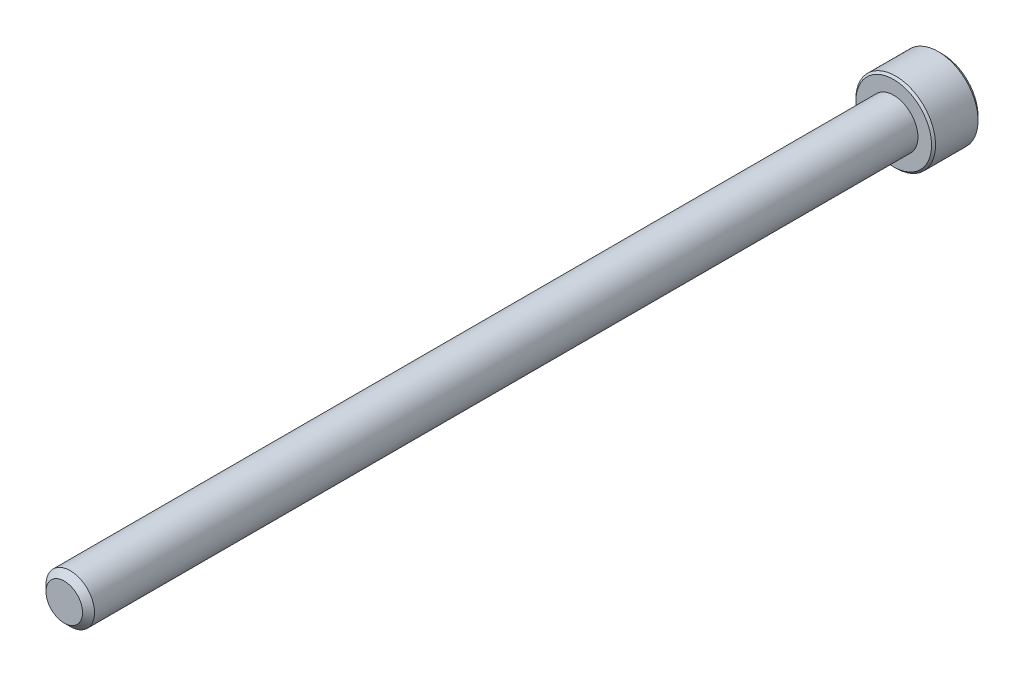
ISO-10303-21;
HEADER;
FILE_DESCRIPTION(('STEP AP214'),'2;1');
FILE_NAME('part.step','',(''),(''),'','','');
FILE_SCHEMA(('AUTOMOTIVE_DESIGN { 1 0 10303 214 1 1 1 1 }'));
ENDSEC;
DATA;
#1=APPLICATION_CONTEXT('core data for automotive mechanical design processes');
#2=APPLICATION_PROTOCOL_DEFINITION('international standard','automotive_design',2000,#1);
#3=PRODUCT_CONTEXT('',#1,'mechanical');
#4=PRODUCT('Part','Part','',(#3));
#5=PRODUCT_RELATED_PRODUCT_CATEGORY('part','',(#4));
#6=PRODUCT_DEFINITION_FORMATION('','',#4);
#7=PRODUCT_DEFINITION_CONTEXT('part definition',#1,'design');
#8=PRODUCT_DEFINITION('design','',#6,#7);
#9=PRODUCT_DEFINITION_SHAPE('','',#8);
#10=(LENGTH_UNIT() NAMED_UNIT(*) SI_UNIT(.MILLI.,.METRE.));
#11=(NAMED_UNIT(*) PLANE_ANGLE_UNIT() SI_UNIT($,.RADIAN.));
#12=(NAMED_UNIT(*) SI_UNIT($,.STERADIAN.) SOLID_ANGLE_UNIT());
#13=UNCERTAINTY_MEASURE_WITH_UNIT(LENGTH_MEASURE(1.E-05),#10,'distance_accuracy_value','');
#14=(GEOMETRIC_REPRESENTATION_CONTEXT(3) GLOBAL_UNCERTAINTY_ASSIGNED_CONTEXT((#13)) GLOBAL_UNIT_ASSIGNED_CONTEXT((#10,
#11,#12)) REPRESENTATION_CONTEXT('',''));
#15=CARTESIAN_POINT('',(0.,0.,0.));
#16=DIRECTION('',(0.,0.,1.));
#17=DIRECTION('',(1.,0.,0.));
#18=AXIS2_PLACEMENT_3D('',#15,#16,#17);
#19=CARTESIAN_POINT('',(0.,0.,-82.55));
#20=DIRECTION('',(0.,0.,1.));
#21=DIRECTION('',(1.,0.,0.));
#22=AXIS2_PLACEMENT_3D('',#19,#20,#21);
#23=CYLINDRICAL_SURFACE('',#22,2.413);
#24=CARTESIAN_POINT('',(0.,0.,-0.595312499999986));
#25=DIRECTION('',(0.,0.,1.));
#26=DIRECTION('',(1.,0.,0.));
#27=AXIS2_PLACEMENT_3D('',#24,#25,#26);
#28=CIRCLE('',#27,2.413);
#29=CARTESIAN_POINT('',(2.413,0.,-0.595312499999986));
#30=VERTEX_POINT('',#29);
#31=EDGE_CURVE('E118',#30,#30,#28,.F.);
#32=ORIENTED_EDGE('',*,*,#31,.T.);
#33=EDGE_LOOP('',(#32));
#34=FACE_BOUND('',#33,.T.);
#35=CARTESIAN_POINT('',(0.,0.,-82.55));
#36=DIRECTION('',(0.,0.,-1.));
#37=DIRECTION('',(-1.,0.,0.));
#38=AXIS2_PLACEMENT_3D('',#35,#36,#37);
#39=CIRCLE('',#38,2.413);
#40=CARTESIAN_POINT('',(-2.413,0.,-82.55));
#41=VERTEX_POINT('',#40);
#42=EDGE_CURVE('E230',#41,#41,#39,.F.);
#43=ORIENTED_EDGE('',*,*,#42,.T.);
#44=EDGE_LOOP('',(#43));
#45=FACE_BOUND('',#44,.T.);
#46=ADVANCED_FACE('F41',(#34,#45),#23,.T.);
#47=CARTESIAN_POINT('',(0.,0.,0.));
#48=DIRECTION('',(0.,0.,1.));
#49=DIRECTION('',(1.,0.,0.));
#50=AXIS2_PLACEMENT_3D('',#47,#48,#49);
#51=PLANE('',#50);
#52=CARTESIAN_POINT('',(0.,0.,0.));
#53=DIRECTION('',(0.,0.,1.));
#54=DIRECTION('',(1.,0.,0.));
#55=AXIS2_PLACEMENT_3D('',#52,#53,#54);
#56=CIRCLE('',#55,1.81768750000001);
#57=CARTESIAN_POINT('',(1.81768750000001,0.,0.));
#58=VERTEX_POINT('',#57);
#59=EDGE_CURVE('E228',#58,#58,#56,.T.);
#60=ORIENTED_EDGE('',*,*,#59,.T.);
#61=EDGE_LOOP('',(#60));
#62=FACE_BOUND('',#61,.T.);
#63=ADVANCED_FACE('F206',(#62),#51,.T.);
#64=CARTESIAN_POINT('',(0.,0.,0.));
#65=DIRECTION('',(0.,0.,-1.));
#66=DIRECTION('',(-1.,0.,0.));
#67=AXIS2_PLACEMENT_3D('',#64,#65,#66);
#68=CONICAL_SURFACE('',#67,1.81768750000001,0.785398163397449);
#69=ORIENTED_EDGE('',*,*,#31,.F.);
#70=EDGE_LOOP('',(#69));
#71=FACE_BOUND('',#70,.T.);
#72=ORIENTED_EDGE('',*,*,#59,.F.);
#73=EDGE_LOOP('',(#72));
#74=FACE_BOUND('',#73,.T.);
#75=ADVANCED_FACE('F212',(#71,#74),#68,.T.);
#76=CARTESIAN_POINT('',(0.,0.,-87.376));
#77=DIRECTION('',(0.,0.,1.));
#78=DIRECTION('',(1.,0.,0.));
#79=AXIS2_PLACEMENT_3D('',#76,#77,#78);
#80=CYLINDRICAL_SURFACE('',#79,3.96875);
#81=CARTESIAN_POINT('',(0.,0.,-82.7484375));
#82=DIRECTION('',(0.,0.,-1.));
#83=DIRECTION('',(-1.,0.,0.));
#84=AXIS2_PLACEMENT_3D('',#81,#82,#83);
#85=CIRCLE('',#84,3.96875);
#86=CARTESIAN_POINT('',(-3.96875,0.,-82.7484375));
#87=VERTEX_POINT('',#86);
#88=EDGE_CURVE('E50',#87,#87,#85,.T.);
#89=ORIENTED_EDGE('',*,*,#88,.T.);
#90=EDGE_LOOP('',(#89));
#91=FACE_BOUND('',#90,.T.);
#92=CARTESIAN_POINT('',(0.,0.,-86.979125));
#93=DIRECTION('',(0.,0.,-1.));
#94=DIRECTION('',(-1.,0.,0.));
#95=AXIS2_PLACEMENT_3D('',#92,#93,#94);
#96=CIRCLE('',#95,3.96875);
#97=CARTESIAN_POINT('',(-3.96875,0.,-86.979125));
#98=VERTEX_POINT('',#97);
#99=EDGE_CURVE('E187',#98,#98,#96,.F.);
#100=ORIENTED_EDGE('',*,*,#99,.T.);
#101=EDGE_LOOP('',(#100));
#102=FACE_BOUND('',#101,.T.);
#103=ADVANCED_FACE('F194',(#91,#102),#80,.T.);
#104=CARTESIAN_POINT('',(0.,0.,-87.376));
#105=DIRECTION('',(0.,0.,-1.));
#106=DIRECTION('',(-1.,0.,0.));
#107=AXIS2_PLACEMENT_3D('',#104,#105,#106);
#108=PLANE('',#107);
#109=CARTESIAN_POINT('',(0.,0.,-87.376));
#110=DIRECTION('',(0.,0.,-1.));
#111=DIRECTION('',(-1.,0.,0.));
#112=AXIS2_PLACEMENT_3D('',#109,#110,#111);
#113=CIRCLE('',#112,3.57187499999997);
#114=CARTESIAN_POINT('',(-3.57187499999997,0.,-87.376));
#115=VERTEX_POINT('',#114);
#116=EDGE_CURVE('E117',#115,#115,#113,.T.);
#117=ORIENTED_EDGE('',*,*,#116,.T.);
#118=EDGE_LOOP('',(#117));
#119=FACE_BOUND('',#118,.T.);
#120=CARTESIAN_POINT('',(0.,0.,-87.376));
#121=DIRECTION('',(0.,0.,-1.));
#122=DIRECTION('',(-1.,0.,0.));
#123=AXIS2_PLACEMENT_3D('',#120,#121,#122);
#124=CIRCLE('',#123,2.29135888084633);
#125=CARTESIAN_POINT('',(-1.984375,1.14567944042317,-87.376));
#126=VERTEX_POINT('',#125);
#127=CARTESIAN_POINT('',(0.,2.29135888084633,-87.376));
#128=VERTEX_POINT('',#127);
#129=EDGE_CURVE('E96',#126,#128,#124,.T.);
#130=ORIENTED_EDGE('',*,*,#129,.F.);
#131=CARTESIAN_POINT('',(-1.984375,-1.14567944042316,-87.376));
#132=VERTEX_POINT('',#131);
#133=EDGE_CURVE('E56',#132,#126,#124,.T.);
#134=ORIENTED_EDGE('',*,*,#133,.F.);
#135=CARTESIAN_POINT('',(0.,-2.29135888084633,-87.376));
#136=VERTEX_POINT('',#135);
#137=EDGE_CURVE('E303',#136,#132,#124,.T.);
#138=ORIENTED_EDGE('',*,*,#137,.F.);
#139=CARTESIAN_POINT('',(1.984375,-1.14567944042316,-87.376));
#140=VERTEX_POINT('',#139);
#141=EDGE_CURVE('E63',#140,#136,#124,.T.);
#142=ORIENTED_EDGE('',*,*,#141,.F.);
#143=CARTESIAN_POINT('',(1.984375,1.14567944042316,-87.376));
#144=VERTEX_POINT('',#143);
#145=EDGE_CURVE('E141',#144,#140,#124,.T.);
#146=ORIENTED_EDGE('',*,*,#145,.F.);
#147=EDGE_CURVE('E106',#128,#144,#124,.T.);
#148=ORIENTED_EDGE('',*,*,#147,.F.);
#149=EDGE_LOOP('',(#130,#134,#138,#142,#146,#148));
#150=FACE_BOUND('',#149,.T.);
#151=ADVANCED_FACE('F140',(#119,#150),#108,.T.);
#152=CARTESIAN_POINT('',(0.,0.,-82.55));
#153=DIRECTION('',(0.,0.,-1.));
#154=DIRECTION('',(-1.,0.,0.));
#155=AXIS2_PLACEMENT_3D('',#152,#153,#154);
#156=PLANE('',#155);
#157=CARTESIAN_POINT('',(0.,0.,-82.55));
#158=DIRECTION('',(0.,0.,-1.));
#159=DIRECTION('',(-1.,0.,0.));
#160=AXIS2_PLACEMENT_3D('',#157,#158,#159);
#161=CIRCLE('',#160,3.77031249999999);
#162=CARTESIAN_POINT('',(-3.77031249999999,0.,-82.55));
#163=VERTEX_POINT('',#162);
#164=EDGE_CURVE('E11',#163,#163,#161,.F.);
#165=ORIENTED_EDGE('',*,*,#164,.T.);
#166=EDGE_LOOP('',(#165));
#167=FACE_BOUND('',#166,.T.);
#168=ORIENTED_EDGE('',*,*,#42,.F.);
#169=EDGE_LOOP('',(#168));
#170=FACE_BOUND('',#169,.T.);
#171=ADVANCED_FACE('F320',(#167,#170),#156,.F.);
#172=CARTESIAN_POINT('',(0.,0.,-87.376));
#173=DIRECTION('',(0.,0.,-1.));
#174=DIRECTION('',(-1.,0.,0.));
#175=AXIS2_PLACEMENT_3D('',#172,#173,#174);
#176=CONICAL_SURFACE('',#175,2.29135888084633,0.78539816339745);
#177=ORIENTED_EDGE('',*,*,#147,.T.);
#178=CARTESIAN_POINT('',(-0.000199999999999604,2.29147435090016,-87.3761154787818));
#179=CARTESIAN_POINT('',(0.068015995166803,2.25208982772757,-87.3367628522639));
#180=CARTESIAN_POINT('',(0.137372685106966,2.21204672412052,-87.2997213104462));
#181=CARTESIAN_POINT('',(0.278798800452188,2.13039431835551,-87.2318988584233));
#182=CARTESIAN_POINT('',(0.350881678736784,2.08877724917394,-87.2011556890917));
#183=CARTESIAN_POINT('',(0.496233397266007,2.00485839535392,-87.1484918888112));
#184=CARTESIAN_POINT('',(0.569465212486942,1.96257798712286,-87.12643887588));
#185=CARTESIAN_POINT('',(0.71754118259471,1.87708628592063,-87.0924614929439));
#186=CARTESIAN_POINT('',(0.792380812753429,1.83387760530244,-87.0805117560917));
#187=CARTESIAN_POINT('',(0.92136041454382,1.75941119748879,-87.0697300990819));
#188=CARTESIAN_POINT('',(0.975333715772447,1.72824969749539,-87.0681338990591));
#189=CARTESIAN_POINT('',(1.08319211851981,1.66597761963484,-87.0708218388653));
#190=CARTESIAN_POINT('',(1.13707718248553,1.63486706344893,-87.0751080403405));
#191=CARTESIAN_POINT('',(1.24433853824861,1.57293969082547,-87.0893168730135));
#192=CARTESIAN_POINT('',(1.29771419276014,1.54212324232506,-87.0992458104523));
#193=CARTESIAN_POINT('',(1.4035425174089,1.48102323060121,-87.1241950842745));
#194=CARTESIAN_POINT('',(1.45599525797111,1.45073962671789,-87.1392150303895));
#195=CARTESIAN_POINT('',(1.59035733896365,1.37316564308797,-87.1838078516357));
#196=CARTESIAN_POINT('',(1.67143335715833,1.32635638215845,-87.2167429959383));
#197=CARTESIAN_POINT('',(1.79064830672984,1.25752759893191,-87.2723424412022));
#198=CARTESIAN_POINT('',(1.829934924386,1.23484545965257,-87.2918775920519));
#199=CARTESIAN_POINT('',(1.90778036186806,1.18990137536712,-87.3327287381194));
#200=CARTESIAN_POINT('',(1.9463396111017,1.16763918244233,-87.3540436395683));
#201=CARTESIAN_POINT('',(1.984575,1.14556397036933,-87.3761154787818));
#202=B_SPLINE_CURVE_WITH_KNOTS('',3,(#178,#179,#180,#181,#182,#183,#184,#185,#186,#187,#188,
#189,#190,#191,#192,#193,#194,#195,#196,#197,#198,#199,#200,#201),.UNSPECIFIED.,.F.,.F.,(4,2,2,
2,2,2,2,2,2,2,2,4),(0.,0.264339630306625,0.530219665093696,0.791876416371465,1.0528742441811,
1.23963984393201,1.42647091743853,1.61351120244035,1.80053715247541,2.09764209964316,
2.24579179873714,2.39385111134157),.UNSPECIFIED.);
#203=EDGE_CURVE('E111',#128,#144,#202,.T.);
#204=ORIENTED_EDGE('',*,*,#203,.F.);
#205=EDGE_LOOP('',(#177,#204));
#206=FACE_BOUND('',#205,.T.);
#207=ADVANCED_FACE('F112',(#206),#176,.F.);
#208=ORIENTED_EDGE('',*,*,#145,.T.);
#209=CARTESIAN_POINT('',(1.984375,-2.28495242191067,-88.1109840790676));
#210=CARTESIAN_POINT('',(1.984375,-2.22931635487714,-88.0689866857921));
#211=CARTESIAN_POINT('',(1.984375,-2.17336876579766,-88.027396054308));
#212=CARTESIAN_POINT('',(1.984375,-2.06072770287667,-87.9452084616839));
#213=CARTESIAN_POINT('',(1.984375,-2.00403404531986,-87.9046117526079));
#214=CARTESIAN_POINT('',(1.984375,-1.88936329200117,-87.8243035033582));
#215=CARTESIAN_POINT('',(1.984375,-1.83137965544999,-87.7846012589872));
#216=CARTESIAN_POINT('',(1.984375,-1.71442802161519,-87.706685173556));
#217=CARTESIAN_POINT('',(1.984375,-1.65546009429911,-87.6684712273396));
#218=CARTESIAN_POINT('',(1.984375,-1.47005472325436,-87.5522528341287));
#219=CARTESIAN_POINT('',(1.984375,-1.3416390944495,-87.4773478869673));
#220=CARTESIAN_POINT('',(1.984375,-1.07840384717679,-87.3403302154972));
#221=CARTESIAN_POINT('',(1.984375,-0.943607781504103,-87.2781743665226));
#222=CARTESIAN_POINT('',(1.984375,-0.741275100522515,-87.202132578716));
#223=CARTESIAN_POINT('',(1.984375,-0.676735408966705,-87.1803080613539));
#224=CARTESIAN_POINT('',(1.984375,-0.546098118214585,-87.1418404635651));
#225=CARTESIAN_POINT('',(1.984375,-0.480000412030015,-87.1251977400917));
#226=CARTESIAN_POINT('',(1.984375,-0.347746170154792,-87.0982353808918));
#227=CARTESIAN_POINT('',(1.984375,-0.281612071613344,-87.087807409755));
#228=CARTESIAN_POINT('',(1.984375,-0.148636620202226,-87.0734781473881));
#229=CARTESIAN_POINT('',(1.984375,-0.0817953908968931,-87.0695757342341));
#230=CARTESIAN_POINT('',(1.984375,0.0495156749172992,-87.0685870513286));
#231=CARTESIAN_POINT('',(1.984375,0.113983774924704,-87.071259178865));
#232=CARTESIAN_POINT('',(1.984375,0.242367515655498,-87.0827392104746));
#233=CARTESIAN_POINT('',(1.984375,0.306283102099371,-87.0915477106093));
#234=CARTESIAN_POINT('',(1.984375,0.434181040054047,-87.1149690212885));
#235=CARTESIAN_POINT('',(1.984375,0.498145026644471,-87.1296806061801));
#236=CARTESIAN_POINT('',(1.984375,0.624675616728318,-87.1641261813447));
#237=CARTESIAN_POINT('',(1.984375,0.68724233666985,-87.183859751374));
#238=CARTESIAN_POINT('',(1.984375,0.884225483546202,-87.2534122371188));
#239=CARTESIAN_POINT('',(1.984375,1.0158367422424,-87.3111524111108));
#240=CARTESIAN_POINT('',(1.984375,1.27288659202272,-87.4395303363718));
#241=CARTESIAN_POINT('',(1.984375,1.39830088226188,-87.5102144246649));
#242=CARTESIAN_POINT('',(1.984375,1.57956687940502,-87.6205166635036));
#243=CARTESIAN_POINT('',(1.984375,1.63738271248116,-87.6569698291489));
#244=CARTESIAN_POINT('',(1.984375,1.7520221533174,-87.7314159629313));
#245=CARTESIAN_POINT('',(1.984375,1.80884568545334,-87.7694090477006));
#246=CARTESIAN_POINT('',(1.984375,1.92116923025134,-87.8463388084819));
#247=CARTESIAN_POINT('',(1.984375,1.97667624451604,-87.8852653126108));
#248=CARTESIAN_POINT('',(1.984375,2.08693170653471,-87.9641477456598));
#249=CARTESIAN_POINT('',(1.984375,2.14168035869579,-88.0041033885457));
#250=CARTESIAN_POINT('',(1.984375,2.19611148979893,-88.0444806107903));
#251=B_SPLINE_CURVE_WITH_KNOTS('',3,(#209,#210,#211,#212,#213,#214,#215,#216,#217,#218,#219,
#220,#221,#222,#223,#224,#225,#226,#227,#228,#229,#230,#231,#232,#233,#234,#235,#236,#237,#238,
#239,#240,#241,#242,#243,#244,#245,#246,#247,#248,#249,#250),.UNSPECIFIED.,.F.,.F.,(4,2,2,2,2,2,
2,2,2,2,2,2,2,2,2,2,2,2,2,2,4),(0.,0.209126070048126,0.418304637436192,0.629103980098184,
0.839888401531932,1.28549951141298,1.72957750802533,1.93379389781847,2.13802435216271,
2.33858179541699,2.53910475375796,2.7323696342393,2.92565329027999,3.12231577116422,
3.31896180058102,3.7488629524628,4.18033428110717,4.38536017158907,4.5904016196826,
4.79377749130339,4.99709743482715),.UNSPECIFIED.);
#252=EDGE_CURVE('E105',#144,#140,#251,.F.);
#253=ORIENTED_EDGE('',*,*,#252,.F.);
#254=EDGE_LOOP('',(#208,#253));
#255=FACE_BOUND('',#254,.T.);
#256=ADVANCED_FACE('F314',(#255),#176,.F.);
#257=ORIENTED_EDGE('',*,*,#141,.T.);
#258=CARTESIAN_POINT('',(1.984575,-1.14556397036933,-87.3761154787818));
#259=CARTESIAN_POINT('',(1.9163590048332,-1.18494849354192,-87.3367628522639));
#260=CARTESIAN_POINT('',(1.84700231489303,-1.22499159714897,-87.2997213104462));
#261=CARTESIAN_POINT('',(1.70557619954781,-1.30664400291398,-87.2318988584233));
#262=CARTESIAN_POINT('',(1.63349332126322,-1.34826107209555,-87.2011556890917));
#263=CARTESIAN_POINT('',(1.48814160273399,-1.43217992591557,-87.1484918888112));
#264=CARTESIAN_POINT('',(1.41490978751306,-1.47446033414663,-87.12643887588));
#265=CARTESIAN_POINT('',(1.26683381740529,-1.55995203534886,-87.0924614929439));
#266=CARTESIAN_POINT('',(1.19199418724657,-1.60316071596705,-87.0805117560917));
#267=CARTESIAN_POINT('',(1.06301458545618,-1.6776271237807,-87.0697300990819));
#268=CARTESIAN_POINT('',(1.00904128422755,-1.7087886237741,-87.0681338990591));
#269=CARTESIAN_POINT('',(0.901182881480196,-1.77106070163465,-87.0708218388653));
#270=CARTESIAN_POINT('',(0.847297817514473,-1.80217125782056,-87.0751080403405));
#271=CARTESIAN_POINT('',(0.740036461751391,-1.86409863044402,-87.0893168730135));
#272=CARTESIAN_POINT('',(0.686660807239855,-1.89491507894443,-87.0992458104523));
#273=CARTESIAN_POINT('',(0.580832482591098,-1.95601509066828,-87.1241950842745));
#274=CARTESIAN_POINT('',(0.528379742028893,-1.9862986945516,-87.1392150303895));
#275=CARTESIAN_POINT('',(0.394017661036344,-2.06387267818153,-87.1838078516357));
#276=CARTESIAN_POINT('',(0.312941642841666,-2.11068193911105,-87.2167429959383));
#277=CARTESIAN_POINT('',(0.193726693270153,-2.17951072233759,-87.2723424412022));
#278=CARTESIAN_POINT('',(0.154440075613995,-2.20219286161692,-87.2918775920519));
#279=CARTESIAN_POINT('',(0.0765946381319476,-2.24713694590237,-87.3327287381194));
#280=CARTESIAN_POINT('',(0.038035388898302,-2.26939913882716,-87.3540436395683));
#281=CARTESIAN_POINT('',(-0.00019999999999915,-2.29147435090016,-87.3761154787818));
#282=B_SPLINE_CURVE_WITH_KNOTS('',3,(#258,#259,#260,#261,#262,#263,#264,#265,#266,#267,#268,
#269,#270,#271,#272,#273,#274,#275,#276,#277,#278,#279,#280,#281),.UNSPECIFIED.,.F.,.F.,(4,2,2,
2,2,2,2,2,2,2,2,4),(0.,0.264339630306625,0.530219665093696,0.791876416371465,1.0528742441811,
1.23963984393201,1.42647091743853,1.61351120244035,1.80053715247541,2.09764209964318,
2.24579179873714,2.39385111134157),.UNSPECIFIED.);
#283=EDGE_CURVE('E154',#140,#136,#282,.T.);
#284=ORIENTED_EDGE('',*,*,#283,.F.);
#285=EDGE_LOOP('',(#257,#284));
#286=FACE_BOUND('',#285,.T.);
#287=ADVANCED_FACE('F311',(#286),#176,.F.);
#288=ORIENTED_EDGE('',*,*,#137,.T.);
#289=CARTESIAN_POINT('',(0.000199999999999881,-2.29147435090016,-87.3761154787818));
#290=CARTESIAN_POINT('',(-0.0680159951668027,-2.25208982772757,-87.3367628522639));
#291=CARTESIAN_POINT('',(-0.137372685106966,-2.21204672412052,-87.2997213104462));
#292=CARTESIAN_POINT('',(-0.278798800452188,-2.13039431835551,-87.2318988584233));
#293=CARTESIAN_POINT('',(-0.350881678736784,-2.08877724917394,-87.2011556890917));
#294=CARTESIAN_POINT('',(-0.496233397266007,-2.00485839535392,-87.1484918888112));
#295=CARTESIAN_POINT('',(-0.569465212486941,-1.96257798712286,-87.12643887588));
#296=CARTESIAN_POINT('',(-0.71754118259471,-1.87708628592063,-87.0924614929439));
#297=CARTESIAN_POINT('',(-0.792380812753429,-1.83387760530244,-87.0805117560917));
#298=CARTESIAN_POINT('',(-0.92136041454382,-1.75941119748879,-87.0697300990819));
#299=CARTESIAN_POINT('',(-0.975333715772447,-1.72824969749539,-87.0681338990591));
#300=CARTESIAN_POINT('',(-1.08319211851981,-1.66597761963484,-87.0708218388653));
#301=CARTESIAN_POINT('',(-1.13707718248553,-1.63486706344893,-87.0751080403405));
#302=CARTESIAN_POINT('',(-1.24433853824861,-1.57293969082547,-87.0893168730135));
#303=CARTESIAN_POINT('',(-1.29771419276014,-1.54212324232506,-87.0992458104523));
#304=CARTESIAN_POINT('',(-1.4035425174089,-1.48102323060121,-87.1241950842745));
#305=CARTESIAN_POINT('',(-1.45599525797111,-1.45073962671789,-87.1392150303895));
#306=CARTESIAN_POINT('',(-1.59035733896365,-1.37316564308797,-87.1838078516357));
#307=CARTESIAN_POINT('',(-1.67143335715833,-1.32635638215845,-87.2167429959383));
#308=CARTESIAN_POINT('',(-1.79064830672984,-1.25752759893191,-87.2723424412022));
#309=CARTESIAN_POINT('',(-1.829934924386,-1.23484545965257,-87.2918775920519));
#310=CARTESIAN_POINT('',(-1.90778036186805,-1.18990137536713,-87.3327287381194));
#311=CARTESIAN_POINT('',(-1.9463396111017,-1.16763918244233,-87.3540436395683));
#312=CARTESIAN_POINT('',(-1.984575,-1.14556397036933,-87.3761154787818));
#313=B_SPLINE_CURVE_WITH_KNOTS('',3,(#289,#290,#291,#292,#293,#294,#295,#296,#297,#298,#299,
#300,#301,#302,#303,#304,#305,#306,#307,#308,#309,#310,#311,#312),.UNSPECIFIED.,.F.,.F.,(4,2,2,
2,2,2,2,2,2,2,2,4),(0.,0.264339630306625,0.530219665093696,0.791876416371465,1.0528742441811,
1.23963984393201,1.42647091743853,1.61351120244035,1.80053715247541,2.09764209964317,
2.24579179873713,2.39385111134157),.UNSPECIFIED.);
#314=EDGE_CURVE('E280',#136,#132,#313,.T.);
#315=ORIENTED_EDGE('',*,*,#314,.F.);
#316=EDGE_LOOP('',(#288,#315));
#317=FACE_BOUND('',#316,.T.);
#318=ADVANCED_FACE('F308',(#317),#176,.F.);
#319=ORIENTED_EDGE('',*,*,#133,.T.);
#320=CARTESIAN_POINT('',(-1.984375,-2.28495242191068,-88.1109840790676));
#321=CARTESIAN_POINT('',(-1.984375,-2.22931635487715,-88.0689866857921));
#322=CARTESIAN_POINT('',(-1.984375,-2.17336876579766,-88.027396054308));
#323=CARTESIAN_POINT('',(-1.984375,-2.06072770287667,-87.9452084616839));
#324=CARTESIAN_POINT('',(-1.984375,-2.00403404531986,-87.9046117526079));
#325=CARTESIAN_POINT('',(-1.984375,-1.88936329200117,-87.8243035033582));
#326=CARTESIAN_POINT('',(-1.984375,-1.83137965544999,-87.7846012589872));
#327=CARTESIAN_POINT('',(-1.984375,-1.71442802161519,-87.706685173556));
#328=CARTESIAN_POINT('',(-1.984375,-1.65546009429912,-87.6684712273396));
#329=CARTESIAN_POINT('',(-1.984375,-1.47005472325436,-87.5522528341287));
#330=CARTESIAN_POINT('',(-1.984375,-1.3416390944495,-87.4773478869673));
#331=CARTESIAN_POINT('',(-1.984375,-1.07840384717679,-87.3403302154972));
#332=CARTESIAN_POINT('',(-1.984375,-0.943607781504103,-87.2781743665226));
#333=CARTESIAN_POINT('',(-1.984375,-0.741275100522518,-87.202132578716));
#334=CARTESIAN_POINT('',(-1.984375,-0.676735408966708,-87.1803080613539));
#335=CARTESIAN_POINT('',(-1.984375,-0.546098118214587,-87.1418404635651));
#336=CARTESIAN_POINT('',(-1.984375,-0.480000412030018,-87.1251977400917));
#337=CARTESIAN_POINT('',(-1.984375,-0.347746170154795,-87.0982353808918));
#338=CARTESIAN_POINT('',(-1.984375,-0.281612071613346,-87.087807409755));
#339=CARTESIAN_POINT('',(-1.984375,-0.148636620202227,-87.0734781473881));
#340=CARTESIAN_POINT('',(-1.984375,-0.081795390896894,-87.0695757342341));
#341=CARTESIAN_POINT('',(-1.984375,0.0495156749172989,-87.0685870513286));
#342=CARTESIAN_POINT('',(-1.984375,0.113983774924704,-87.071259178865));
#343=CARTESIAN_POINT('',(-1.984375,0.242367515655499,-87.0827392104746));
#344=CARTESIAN_POINT('',(-1.984375,0.306283102099372,-87.0915477106093));
#345=CARTESIAN_POINT('',(-1.984375,0.434181040054048,-87.1149690212885));
#346=CARTESIAN_POINT('',(-1.984375,0.498145026644472,-87.1296806061801));
#347=CARTESIAN_POINT('',(-1.984375,0.62467561672832,-87.1641261813447));
#348=CARTESIAN_POINT('',(-1.984375,0.687242336669852,-87.183859751374));
#349=CARTESIAN_POINT('',(-1.984375,0.884225483546202,-87.2534122371188));
#350=CARTESIAN_POINT('',(-1.984375,1.0158367422424,-87.3111524111108));
#351=CARTESIAN_POINT('',(-1.984375,1.27288659202271,-87.4395303363718));
#352=CARTESIAN_POINT('',(-1.984375,1.39830088226188,-87.5102144246649));
#353=CARTESIAN_POINT('',(-1.984375,1.57956687940502,-87.6205166635036));
#354=CARTESIAN_POINT('',(-1.984375,1.63738271248116,-87.6569698291489));
#355=CARTESIAN_POINT('',(-1.984375,1.7520221533174,-87.7314159629313));
#356=CARTESIAN_POINT('',(-1.984375,1.80884568545334,-87.7694090477007));
#357=CARTESIAN_POINT('',(-1.984375,1.92116923025135,-87.8463388084819));
#358=CARTESIAN_POINT('',(-1.984375,1.97667624451605,-87.8852653126108));
#359=CARTESIAN_POINT('',(-1.984375,2.08693170653472,-87.9641477456598));
#360=CARTESIAN_POINT('',(-1.984375,2.1416803586958,-88.0041033885457));
#361=CARTESIAN_POINT('',(-1.984375,2.19611148979893,-88.0444806107903));
#362=B_SPLINE_CURVE_WITH_KNOTS('',3,(#320,#321,#322,#323,#324,#325,#326,#327,#328,#329,#330,
#331,#332,#333,#334,#335,#336,#337,#338,#339,#340,#341,#342,#343,#344,#345,#346,#347,#348,#349,
#350,#351,#352,#353,#354,#355,#356,#357,#358,#359,#360,#361),.UNSPECIFIED.,.F.,.F.,(4,2,2,2,2,2,
2,2,2,2,2,2,2,2,2,2,2,2,2,2,4),(0.,0.209126070048127,0.418304637436193,0.629103980098185,
0.839888401531933,1.28549951141299,1.72957750802533,1.93379389781847,2.13802435216271,
2.33858179541699,2.53910475375796,2.7323696342393,2.92565329027999,3.12231577116422,
3.31896180058102,3.7488629524628,4.18033428110717,4.38536017158907,4.59040161968261,
4.79377749130339,4.99709743482716),.UNSPECIFIED.);
#363=EDGE_CURVE('E129',#132,#126,#362,.T.);
#364=ORIENTED_EDGE('',*,*,#363,.F.);
#365=EDGE_LOOP('',(#319,#364));
#366=FACE_BOUND('',#365,.T.);
#367=ADVANCED_FACE('F327',(#366),#176,.F.);
#368=ORIENTED_EDGE('',*,*,#129,.T.);
#369=CARTESIAN_POINT('',(-1.984575,1.14556397036933,-87.3761154787818));
#370=CARTESIAN_POINT('',(-1.9163590048332,1.18494849354192,-87.3367628522639));
#371=CARTESIAN_POINT('',(-1.84700231489303,1.22499159714897,-87.2997213104462));
#372=CARTESIAN_POINT('',(-1.70557619954781,1.30664400291398,-87.2318988584233));
#373=CARTESIAN_POINT('',(-1.63349332126321,1.34826107209555,-87.2011556890917));
#374=CARTESIAN_POINT('',(-1.48814160273399,1.43217992591558,-87.1484918888112));
#375=CARTESIAN_POINT('',(-1.41490978751306,1.47446033414663,-87.12643887588));
#376=CARTESIAN_POINT('',(-1.26683381740529,1.55995203534886,-87.0924614929439));
#377=CARTESIAN_POINT('',(-1.19199418724657,1.60316071596705,-87.0805117560917));
#378=CARTESIAN_POINT('',(-1.06301458545618,1.6776271237807,-87.0697300990819));
#379=CARTESIAN_POINT('',(-1.00904128422755,1.7087886237741,-87.0681338990591));
#380=CARTESIAN_POINT('',(-0.901182881480194,1.77106070163465,-87.0708218388653));
#381=CARTESIAN_POINT('',(-0.847297817514471,1.80217125782056,-87.0751080403405));
#382=CARTESIAN_POINT('',(-0.74003646175139,1.86409863044402,-87.0893168730135));
#383=CARTESIAN_POINT('',(-0.686660807239853,1.89491507894443,-87.0992458104523));
#384=CARTESIAN_POINT('',(-0.580832482591096,1.95601509066828,-87.1241950842745));
#385=CARTESIAN_POINT('',(-0.528379742028891,1.9862986945516,-87.1392150303895));
#386=CARTESIAN_POINT('',(-0.394017661036345,2.06387267818153,-87.1838078516357));
#387=CARTESIAN_POINT('',(-0.312941642841673,2.11068193911104,-87.2167429959383));
#388=CARTESIAN_POINT('',(-0.193726693270159,2.17951072233758,-87.2723424412022));
#389=CARTESIAN_POINT('',(-0.154440075613997,2.20219286161692,-87.2918775920519));
#390=CARTESIAN_POINT('',(-0.0765946381319461,2.24713694590237,-87.3327287381194));
#391=CARTESIAN_POINT('',(-0.0380353888983003,2.26939913882716,-87.3540436395683));
#392=CARTESIAN_POINT('',(0.000199999999999866,2.29147435090016,-87.3761154787818));
#393=B_SPLINE_CURVE_WITH_KNOTS('',3,(#369,#370,#371,#372,#373,#374,#375,#376,#377,#378,#379,
#380,#381,#382,#383,#384,#385,#386,#387,#388,#389,#390,#391,#392),.UNSPECIFIED.,.F.,.F.,(4,2,2,
2,2,2,2,2,2,2,2,4),(0.,0.264339630306624,0.530219665093696,0.791876416371465,1.0528742441811,
1.23963984393201,1.42647091743853,1.61351120244035,1.80053715247541,2.09764209964317,
2.24579179873713,2.39385111134157),.UNSPECIFIED.);
#394=EDGE_CURVE('E100',#126,#128,#393,.T.);
#395=ORIENTED_EDGE('',*,*,#394,.F.);
#396=EDGE_LOOP('',(#368,#395));
#397=FACE_BOUND('',#396,.T.);
#398=ADVANCED_FACE('F98',(#397),#176,.F.);
#399=CARTESIAN_POINT('',(1.984375,3.43703832126949,-84.3994375));
#400=DIRECTION('',(0.,0.,-1.));
#401=DIRECTION('',(-1.,0.,0.));
#402=AXIS2_PLACEMENT_3D('',#399,#400,#401);
#403=PLANE('',#402);
#404=DIRECTION('',(0.866025403784439,0.5,0.));
#405=VECTOR('',#404,1.);
#406=CARTESIAN_POINT('',(-1.984375,1.14567944042316,-84.3994375));
#407=LINE('',#406,#405);
#408=CARTESIAN_POINT('',(-1.984375,1.14567944042316,-84.3994375));
#409=VERTEX_POINT('',#408);
#410=CARTESIAN_POINT('',(0.,2.29135888084633,-84.3994375));
#411=VERTEX_POINT('',#410);
#412=EDGE_CURVE('E128',#409,#411,#407,.T.);
#413=ORIENTED_EDGE('',*,*,#412,.T.);
#414=DIRECTION('',(0.866025403784439,-0.5,0.));
#415=VECTOR('',#414,1.);
#416=CARTESIAN_POINT('',(0.,2.29135888084633,-84.3994375));
#417=LINE('',#416,#415);
#418=CARTESIAN_POINT('',(1.984375,1.14567944042316,-84.3994375));
#419=VERTEX_POINT('',#418);
#420=EDGE_CURVE('E133',#411,#419,#417,.T.);
#421=ORIENTED_EDGE('',*,*,#420,.T.);
#422=DIRECTION('',(0.,-1.,0.));
#423=VECTOR('',#422,1.);
#424=CARTESIAN_POINT('',(1.984375,1.14567944042316,-84.3994375));
#425=LINE('',#424,#423);
#426=CARTESIAN_POINT('',(1.984375,-1.14567944042316,-84.3994375));
#427=VERTEX_POINT('',#426);
#428=EDGE_CURVE('E262',#419,#427,#425,.T.);
#429=ORIENTED_EDGE('',*,*,#428,.T.);
#430=DIRECTION('',(-0.866025403784439,-0.5,0.));
#431=VECTOR('',#430,1.);
#432=CARTESIAN_POINT('',(1.984375,-1.14567944042316,-84.3994375));
#433=LINE('',#432,#431);
#434=CARTESIAN_POINT('',(0.,-2.29135888084633,-84.3994375));
#435=VERTEX_POINT('',#434);
#436=EDGE_CURVE('E258',#427,#435,#433,.T.);
#437=ORIENTED_EDGE('',*,*,#436,.T.);
#438=DIRECTION('',(-0.866025403784439,0.5,0.));
#439=VECTOR('',#438,1.);
#440=CARTESIAN_POINT('',(0.,-2.29135888084633,-84.3994375));
#441=LINE('',#440,#439);
#442=CARTESIAN_POINT('',(-1.984375,-1.14567944042316,-84.3994375));
#443=VERTEX_POINT('',#442);
#444=EDGE_CURVE('E254',#435,#443,#441,.T.);
#445=ORIENTED_EDGE('',*,*,#444,.T.);
#446=DIRECTION('',(0.,1.,0.));
#447=VECTOR('',#446,1.);
#448=CARTESIAN_POINT('',(-1.984375,-1.14567944042316,-84.3994375));
#449=LINE('',#448,#447);
#450=EDGE_CURVE('E137',#443,#409,#449,.T.);
#451=ORIENTED_EDGE('',*,*,#450,.T.);
#452=EDGE_LOOP('',(#413,#421,#429,#437,#445,#451));
#453=FACE_BOUND('',#452,.T.);
#454=ADVANCED_FACE('F174',(#453),#403,.T.);
#455=CARTESIAN_POINT('',(0.,2.29135888084633,-84.3994375));
#456=DIRECTION('',(0.5,0.866025403784439,0.));
#457=DIRECTION('',(-0.866025403784439,0.5,0.));
#458=AXIS2_PLACEMENT_3D('',#455,#456,#457);
#459=PLANE('',#458);
#460=DIRECTION('',(0.,0.,-1.));
#461=VECTOR('',#460,1.);
#462=CARTESIAN_POINT('',(0.,2.29135888084633,-84.3994375));
#463=LINE('',#462,#461);
#464=EDGE_CURVE('E124',#411,#128,#463,.T.);
#465=ORIENTED_EDGE('',*,*,#464,.T.);
#466=ORIENTED_EDGE('',*,*,#203,.T.);
#467=DIRECTION('',(0.,0.,-1.));
#468=VECTOR('',#467,1.);
#469=CARTESIAN_POINT('',(1.984375,1.14567944042316,-84.3994375));
#470=LINE('',#469,#468);
#471=EDGE_CURVE('E136',#419,#144,#470,.T.);
#472=ORIENTED_EDGE('',*,*,#471,.F.);
#473=ORIENTED_EDGE('',*,*,#420,.F.);
#474=EDGE_LOOP('',(#465,#466,#472,#473));
#475=FACE_BOUND('',#474,.T.);
#476=ADVANCED_FACE('F131',(#475),#459,.F.);
#477=CARTESIAN_POINT('',(1.984375,1.14567944042316,-84.3994375));
#478=DIRECTION('',(1.,0.,0.));
#479=DIRECTION('',(0.,1.,0.));
#480=AXIS2_PLACEMENT_3D('',#477,#478,#479);
#481=PLANE('',#480);
#482=ORIENTED_EDGE('',*,*,#471,.T.);
#483=ORIENTED_EDGE('',*,*,#252,.T.);
#484=DIRECTION('',(0.,0.,-1.));
#485=VECTOR('',#484,1.);
#486=CARTESIAN_POINT('',(1.984375,-1.14567944042316,-84.3994375));
#487=LINE('',#486,#485);
#488=EDGE_CURVE('E238',#427,#140,#487,.T.);
#489=ORIENTED_EDGE('',*,*,#488,.F.);
#490=ORIENTED_EDGE('',*,*,#428,.F.);
#491=EDGE_LOOP('',(#482,#483,#489,#490));
#492=FACE_BOUND('',#491,.T.);
#493=ADVANCED_FACE('F163',(#492),#481,.F.);
#494=CARTESIAN_POINT('',(1.984375,-1.14567944042316,-84.3994375));
#495=DIRECTION('',(0.5,-0.866025403784439,0.));
#496=DIRECTION('',(0.866025403784439,0.5,0.));
#497=AXIS2_PLACEMENT_3D('',#494,#495,#496);
#498=PLANE('',#497);
#499=ORIENTED_EDGE('',*,*,#488,.T.);
#500=ORIENTED_EDGE('',*,*,#283,.T.);
#501=DIRECTION('',(0.,0.,-1.));
#502=VECTOR('',#501,1.);
#503=CARTESIAN_POINT('',(0.,-2.29135888084633,-84.3994375));
#504=LINE('',#503,#502);
#505=EDGE_CURVE('E242',#435,#136,#504,.T.);
#506=ORIENTED_EDGE('',*,*,#505,.F.);
#507=ORIENTED_EDGE('',*,*,#436,.F.);
#508=EDGE_LOOP('',(#499,#500,#506,#507));
#509=FACE_BOUND('',#508,.T.);
#510=ADVANCED_FACE('F167',(#509),#498,.F.);
#511=CARTESIAN_POINT('',(0.,-2.29135888084633,-84.3994375));
#512=DIRECTION('',(-0.5,-0.866025403784439,0.));
#513=DIRECTION('',(0.866025403784439,-0.5,0.));
#514=AXIS2_PLACEMENT_3D('',#511,#512,#513);
#515=PLANE('',#514);
#516=ORIENTED_EDGE('',*,*,#505,.T.);
#517=ORIENTED_EDGE('',*,*,#314,.T.);
#518=DIRECTION('',(0.,0.,-1.));
#519=VECTOR('',#518,1.);
#520=CARTESIAN_POINT('',(-1.984375,-1.14567944042316,-84.3994375));
#521=LINE('',#520,#519);
#522=EDGE_CURVE('E246',#443,#132,#521,.T.);
#523=ORIENTED_EDGE('',*,*,#522,.F.);
#524=ORIENTED_EDGE('',*,*,#444,.F.);
#525=EDGE_LOOP('',(#516,#517,#523,#524));
#526=FACE_BOUND('',#525,.T.);
#527=ADVANCED_FACE('F288',(#526),#515,.F.);
#528=CARTESIAN_POINT('',(-1.984375,-1.14567944042316,-84.3994375));
#529=DIRECTION('',(-1.,0.,0.));
#530=DIRECTION('',(0.,-1.,0.));
#531=AXIS2_PLACEMENT_3D('',#528,#529,#530);
#532=PLANE('',#531);
#533=ORIENTED_EDGE('',*,*,#522,.T.);
#534=ORIENTED_EDGE('',*,*,#363,.T.);
#535=DIRECTION('',(0.,0.,-1.));
#536=VECTOR('',#535,1.);
#537=CARTESIAN_POINT('',(-1.984375,1.14567944042316,-84.3994375));
#538=LINE('',#537,#536);
#539=EDGE_CURVE('E126',#409,#126,#538,.T.);
#540=ORIENTED_EDGE('',*,*,#539,.F.);
#541=ORIENTED_EDGE('',*,*,#450,.F.);
#542=EDGE_LOOP('',(#533,#534,#540,#541));
#543=FACE_BOUND('',#542,.T.);
#544=ADVANCED_FACE('F285',(#543),#532,.F.);
#545=CARTESIAN_POINT('',(-1.984375,1.14567944042316,-84.3994375));
#546=DIRECTION('',(-0.5,0.866025403784439,0.));
#547=DIRECTION('',(-0.866025403784439,-0.5,0.));
#548=AXIS2_PLACEMENT_3D('',#545,#546,#547);
#549=PLANE('',#548);
#550=ORIENTED_EDGE('',*,*,#539,.T.);
#551=ORIENTED_EDGE('',*,*,#394,.T.);
#552=ORIENTED_EDGE('',*,*,#464,.F.);
#553=ORIENTED_EDGE('',*,*,#412,.F.);
#554=EDGE_LOOP('',(#550,#551,#552,#553));
#555=FACE_BOUND('',#554,.T.);
#556=ADVANCED_FACE('F122',(#555),#549,.F.);
#557=CARTESIAN_POINT('',(0.,0.,-87.376));
#558=DIRECTION('',(0.,0.,1.));
#559=DIRECTION('',(1.,0.,0.));
#560=AXIS2_PLACEMENT_3D('',#557,#558,#559);
#561=CONICAL_SURFACE('',#560,3.57187499999997,0.785398163397457);
#562=ORIENTED_EDGE('',*,*,#99,.F.);
#563=EDGE_LOOP('',(#562));
#564=FACE_BOUND('',#563,.T.);
#565=ORIENTED_EDGE('',*,*,#116,.F.);
#566=EDGE_LOOP('',(#565));
#567=FACE_BOUND('',#566,.T.);
#568=ADVANCED_FACE('F198',(#564,#567),#561,.T.);
#569=CARTESIAN_POINT('',(0.,0.,-82.7484375));
#570=DIRECTION('',(0.,0.,-1.));
#571=DIRECTION('',(-1.,0.,0.));
#572=AXIS2_PLACEMENT_3D('',#569,#570,#571);
#573=CONICAL_SURFACE('',#572,3.96875,0.785398163397413);
#574=ORIENTED_EDGE('',*,*,#164,.F.);
#575=EDGE_LOOP('',(#574));
#576=FACE_BOUND('',#575,.T.);
#577=ORIENTED_EDGE('',*,*,#88,.F.);
#578=EDGE_LOOP('',(#577));
#579=FACE_BOUND('',#578,.T.);
#580=ADVANCED_FACE('F43',(#576,#579),#573,.T.);
#581=CLOSED_SHELL('',(#46,#63,#75,#103,#151,#171,#207,#256,#287,#318,#367,#398,#454,#476,#493,
#510,#527,#544,#556,#568,#580));
#582=MANIFOLD_SOLID_BREP('B2',#581);
#583=ADVANCED_BREP_SHAPE_REPRESENTATION('',(#18,#582),#14);
#584=SHAPE_DEFINITION_REPRESENTATION(#9,#583);
ENDSEC;
END-ISO-10303-21;
